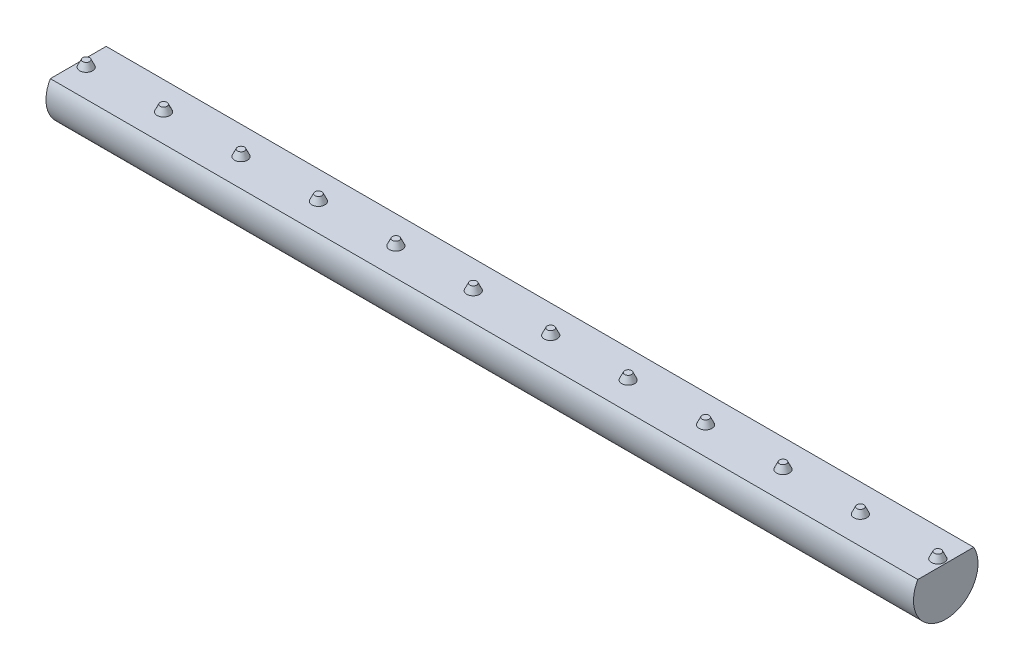
ISO-10303-21;
HEADER;
FILE_DESCRIPTION(('STEP AP214'),'2;1');
FILE_NAME('part.step','',(''),(''),'','','');
FILE_SCHEMA(('AUTOMOTIVE_DESIGN { 1 0 10303 214 1 1 1 1 }'));
ENDSEC;
DATA;
#1=APPLICATION_CONTEXT('core data for automotive mechanical design processes');
#2=APPLICATION_PROTOCOL_DEFINITION('international standard','automotive_design',2000,#1);
#3=PRODUCT_CONTEXT('',#1,'mechanical');
#4=PRODUCT('Part','Part','',(#3));
#5=PRODUCT_RELATED_PRODUCT_CATEGORY('part','',(#4));
#6=PRODUCT_DEFINITION_FORMATION('','',#4);
#7=PRODUCT_DEFINITION_CONTEXT('part definition',#1,'design');
#8=PRODUCT_DEFINITION('design','',#6,#7);
#9=PRODUCT_DEFINITION_SHAPE('','',#8);
#10=(LENGTH_UNIT() NAMED_UNIT(*) SI_UNIT(.MILLI.,.METRE.));
#11=(NAMED_UNIT(*) PLANE_ANGLE_UNIT() SI_UNIT($,.RADIAN.));
#12=(NAMED_UNIT(*) SI_UNIT($,.STERADIAN.) SOLID_ANGLE_UNIT());
#13=UNCERTAINTY_MEASURE_WITH_UNIT(LENGTH_MEASURE(1.E-05),#10,'distance_accuracy_value','');
#14=(GEOMETRIC_REPRESENTATION_CONTEXT(3) GLOBAL_UNCERTAINTY_ASSIGNED_CONTEXT((#13)) GLOBAL_UNIT_ASSIGNED_CONTEXT((#10,
#11,#12)) REPRESENTATION_CONTEXT('',''));
#15=CARTESIAN_POINT('',(0.,0.,0.));
#16=DIRECTION('',(0.,0.,1.));
#17=DIRECTION('',(1.,0.,0.));
#18=AXIS2_PLACEMENT_3D('',#15,#16,#17);
#19=CARTESIAN_POINT('',(134.46,2.5,4.33012701892219));
#20=DIRECTION('',(0.,-1.,0.));
#21=DIRECTION('',(0.,0.,-1.));
#22=AXIS2_PLACEMENT_3D('',#19,#20,#21);
#23=PLANE('',#22);
#24=CARTESIAN_POINT('',(121.229,2.5,0.));
#25=DIRECTION('',(0.,-1.,0.));
#26=DIRECTION('',(0.,0.,-1.));
#27=AXIS2_PLACEMENT_3D('',#24,#25,#26);
#28=CIRCLE('',#27,1.);
#29=CARTESIAN_POINT('',(121.229,2.5,-1.));
#30=VERTEX_POINT('',#29);
#31=EDGE_CURVE('E42',#30,#30,#28,.F.);
#32=ORIENTED_EDGE('',*,*,#31,.F.);
#33=EDGE_LOOP('',(#32));
#34=FACE_BOUND('',#33,.T.);
#35=CARTESIAN_POINT('',(97.229,2.5,0.));
#36=DIRECTION('',(0.,-1.,0.));
#37=DIRECTION('',(0.,0.,-1.));
#38=AXIS2_PLACEMENT_3D('',#35,#36,#37);
#39=CIRCLE('',#38,1.);
#40=CARTESIAN_POINT('',(97.229,2.5,-1.));
#41=VERTEX_POINT('',#40);
#42=EDGE_CURVE('E106',#41,#41,#39,.F.);
#43=ORIENTED_EDGE('',*,*,#42,.F.);
#44=EDGE_LOOP('',(#43));
#45=FACE_BOUND('',#44,.T.);
#46=CARTESIAN_POINT('',(73.229,2.5,0.));
#47=DIRECTION('',(0.,-1.,0.));
#48=DIRECTION('',(0.,0.,-1.));
#49=AXIS2_PLACEMENT_3D('',#46,#47,#48);
#50=CIRCLE('',#49,1.);
#51=CARTESIAN_POINT('',(73.229,2.5,-1.));
#52=VERTEX_POINT('',#51);
#53=EDGE_CURVE('E100',#52,#52,#50,.F.);
#54=ORIENTED_EDGE('',*,*,#53,.F.);
#55=EDGE_LOOP('',(#54));
#56=FACE_BOUND('',#55,.T.);
#57=CARTESIAN_POINT('',(49.229,2.5,0.));
#58=DIRECTION('',(0.,-1.,0.));
#59=DIRECTION('',(0.,0.,-1.));
#60=AXIS2_PLACEMENT_3D('',#57,#58,#59);
#61=CIRCLE('',#60,1.);
#62=CARTESIAN_POINT('',(49.229,2.5,-1.));
#63=VERTEX_POINT('',#62);
#64=EDGE_CURVE('E94',#63,#63,#61,.F.);
#65=ORIENTED_EDGE('',*,*,#64,.F.);
#66=EDGE_LOOP('',(#65));
#67=FACE_BOUND('',#66,.T.);
#68=CARTESIAN_POINT('',(25.229,2.5,0.));
#69=DIRECTION('',(0.,-1.,0.));
#70=DIRECTION('',(0.,0.,-1.));
#71=AXIS2_PLACEMENT_3D('',#68,#69,#70);
#72=CIRCLE('',#71,1.);
#73=CARTESIAN_POINT('',(25.229,2.5,-1.));
#74=VERTEX_POINT('',#73);
#75=EDGE_CURVE('E88',#74,#74,#72,.F.);
#76=ORIENTED_EDGE('',*,*,#75,.F.);
#77=EDGE_LOOP('',(#76));
#78=FACE_BOUND('',#77,.T.);
#79=CARTESIAN_POINT('',(1.229,2.5,0.));
#80=DIRECTION('',(0.,-1.,0.));
#81=DIRECTION('',(0.,0.,-1.));
#82=AXIS2_PLACEMENT_3D('',#79,#80,#81);
#83=CIRCLE('',#82,1.);
#84=CARTESIAN_POINT('',(1.229,2.5,-1.));
#85=VERTEX_POINT('',#84);
#86=EDGE_CURVE('E82',#85,#85,#83,.F.);
#87=ORIENTED_EDGE('',*,*,#86,.F.);
#88=EDGE_LOOP('',(#87));
#89=FACE_BOUND('',#88,.T.);
#90=DIRECTION('',(0.,0.,1.));
#91=VECTOR('',#90,1.);
#92=CARTESIAN_POINT('',(0.,2.5,4.33012701892219));
#93=LINE('',#92,#91);
#94=CARTESIAN_POINT('',(0.,2.5,-4.33012701892219));
#95=VERTEX_POINT('',#94);
#96=CARTESIAN_POINT('',(0.,2.5,4.33012701892219));
#97=VERTEX_POINT('',#96);
#98=EDGE_CURVE('E57',#95,#97,#93,.T.);
#99=ORIENTED_EDGE('',*,*,#98,.T.);
#100=DIRECTION('',(-1.,0.,0.));
#101=VECTOR('',#100,1.);
#102=CARTESIAN_POINT('',(134.46,2.5,4.33012701892219));
#103=LINE('',#102,#101);
#104=CARTESIAN_POINT('',(134.46,2.5,4.33012701892219));
#105=VERTEX_POINT('',#104);
#106=EDGE_CURVE('E62',#105,#97,#103,.T.);
#107=ORIENTED_EDGE('',*,*,#106,.F.);
#108=DIRECTION('',(0.,0.,1.));
#109=VECTOR('',#108,1.);
#110=CARTESIAN_POINT('',(134.46,2.5,4.33012701892219));
#111=LINE('',#110,#109);
#112=CARTESIAN_POINT('',(134.46,2.5,-4.33012701892219));
#113=VERTEX_POINT('',#112);
#114=EDGE_CURVE('E49',#113,#105,#111,.T.);
#115=ORIENTED_EDGE('',*,*,#114,.F.);
#116=DIRECTION('',(-1.,0.,0.));
#117=VECTOR('',#116,1.);
#118=CARTESIAN_POINT('',(134.46,2.5,-4.33012701892219));
#119=LINE('',#118,#117);
#120=EDGE_CURVE('E65',#113,#95,#119,.T.);
#121=ORIENTED_EDGE('',*,*,#120,.T.);
#122=EDGE_LOOP('',(#99,#107,#115,#121));
#123=FACE_BOUND('',#122,.T.);
#124=CARTESIAN_POINT('',(13.229,2.5,0.));
#125=DIRECTION('',(0.,-1.,0.));
#126=DIRECTION('',(0.,0.,-1.));
#127=AXIS2_PLACEMENT_3D('',#124,#125,#126);
#128=CIRCLE('',#127,1.);
#129=CARTESIAN_POINT('',(13.229,2.5,-1.));
#130=VERTEX_POINT('',#129);
#131=EDGE_CURVE('E85',#130,#130,#128,.F.);
#132=ORIENTED_EDGE('',*,*,#131,.F.);
#133=EDGE_LOOP('',(#132));
#134=FACE_BOUND('',#133,.T.);
#135=CARTESIAN_POINT('',(37.229,2.5,0.));
#136=DIRECTION('',(0.,-1.,0.));
#137=DIRECTION('',(0.,0.,-1.));
#138=AXIS2_PLACEMENT_3D('',#135,#136,#137);
#139=CIRCLE('',#138,1.);
#140=CARTESIAN_POINT('',(37.229,2.5,-1.));
#141=VERTEX_POINT('',#140);
#142=EDGE_CURVE('E91',#141,#141,#139,.F.);
#143=ORIENTED_EDGE('',*,*,#142,.F.);
#144=EDGE_LOOP('',(#143));
#145=FACE_BOUND('',#144,.T.);
#146=CARTESIAN_POINT('',(61.229,2.5,0.));
#147=DIRECTION('',(0.,-1.,0.));
#148=DIRECTION('',(0.,0.,-1.));
#149=AXIS2_PLACEMENT_3D('',#146,#147,#148);
#150=CIRCLE('',#149,1.);
#151=CARTESIAN_POINT('',(61.229,2.5,-1.));
#152=VERTEX_POINT('',#151);
#153=EDGE_CURVE('E97',#152,#152,#150,.F.);
#154=ORIENTED_EDGE('',*,*,#153,.F.);
#155=EDGE_LOOP('',(#154));
#156=FACE_BOUND('',#155,.T.);
#157=CARTESIAN_POINT('',(85.229,2.5,0.));
#158=DIRECTION('',(0.,-1.,0.));
#159=DIRECTION('',(0.,0.,-1.));
#160=AXIS2_PLACEMENT_3D('',#157,#158,#159);
#161=CIRCLE('',#160,1.);
#162=CARTESIAN_POINT('',(85.229,2.5,-1.));
#163=VERTEX_POINT('',#162);
#164=EDGE_CURVE('E103',#163,#163,#161,.F.);
#165=ORIENTED_EDGE('',*,*,#164,.F.);
#166=EDGE_LOOP('',(#165));
#167=FACE_BOUND('',#166,.T.);
#168=CARTESIAN_POINT('',(109.229,2.5,0.));
#169=DIRECTION('',(0.,-1.,0.));
#170=DIRECTION('',(0.,0.,-1.));
#171=AXIS2_PLACEMENT_3D('',#168,#169,#170);
#172=CIRCLE('',#171,1.);
#173=CARTESIAN_POINT('',(109.229,2.5,-1.));
#174=VERTEX_POINT('',#173);
#175=EDGE_CURVE('E109',#174,#174,#172,.F.);
#176=ORIENTED_EDGE('',*,*,#175,.F.);
#177=EDGE_LOOP('',(#176));
#178=FACE_BOUND('',#177,.T.);
#179=CARTESIAN_POINT('',(133.229,2.5,0.));
#180=DIRECTION('',(0.,-1.,0.));
#181=DIRECTION('',(0.,0.,-1.));
#182=AXIS2_PLACEMENT_3D('',#179,#180,#181);
#183=CIRCLE('',#182,1.);
#184=CARTESIAN_POINT('',(133.229,2.5,-1.));
#185=VERTEX_POINT('',#184);
#186=EDGE_CURVE('E11',#185,#185,#183,.F.);
#187=ORIENTED_EDGE('',*,*,#186,.F.);
#188=EDGE_LOOP('',(#187));
#189=FACE_BOUND('',#188,.T.);
#190=ADVANCED_FACE('F33',(#34,#45,#56,#67,#78,#89,#123,#134,#145,#156,#167,#178,#189),#23,.F.);
#191=CARTESIAN_POINT('',(134.46,0.,0.));
#192=DIRECTION('',(-1.,0.,0.));
#193=DIRECTION('',(0.,0.,1.));
#194=AXIS2_PLACEMENT_3D('',#191,#192,#193);
#195=CYLINDRICAL_SURFACE('',#194,5.);
#196=CARTESIAN_POINT('',(0.,0.,0.));
#197=DIRECTION('',(1.,0.,0.));
#198=DIRECTION('',(0.,0.,-1.));
#199=AXIS2_PLACEMENT_3D('',#196,#197,#198);
#200=CIRCLE('',#199,5.);
#201=EDGE_CURVE('E68',#97,#95,#200,.T.);
#202=ORIENTED_EDGE('',*,*,#201,.T.);
#203=ORIENTED_EDGE('',*,*,#120,.F.);
#204=CARTESIAN_POINT('',(134.46,0.,0.));
#205=DIRECTION('',(1.,0.,0.));
#206=DIRECTION('',(0.,0.,-1.));
#207=AXIS2_PLACEMENT_3D('',#204,#205,#206);
#208=CIRCLE('',#207,5.);
#209=EDGE_CURVE('E67',#105,#113,#208,.T.);
#210=ORIENTED_EDGE('',*,*,#209,.F.);
#211=ORIENTED_EDGE('',*,*,#106,.T.);
#212=EDGE_LOOP('',(#202,#203,#210,#211));
#213=FACE_BOUND('',#212,.T.);
#214=ADVANCED_FACE('F35',(#213),#195,.T.);
#215=CARTESIAN_POINT('',(134.46,0.,0.));
#216=DIRECTION('',(1.,0.,0.));
#217=DIRECTION('',(0.,0.,-1.));
#218=AXIS2_PLACEMENT_3D('',#215,#216,#217);
#219=PLANE('',#218);
#220=ORIENTED_EDGE('',*,*,#209,.T.);
#221=ORIENTED_EDGE('',*,*,#114,.T.);
#222=EDGE_LOOP('',(#220,#221));
#223=FACE_BOUND('',#222,.T.);
#224=ADVANCED_FACE('F140',(#223),#219,.T.);
#225=CARTESIAN_POINT('',(0.,0.,0.));
#226=DIRECTION('',(1.,0.,0.));
#227=DIRECTION('',(0.,0.,-1.));
#228=AXIS2_PLACEMENT_3D('',#225,#226,#227);
#229=PLANE('',#228);
#230=ORIENTED_EDGE('',*,*,#201,.F.);
#231=ORIENTED_EDGE('',*,*,#98,.F.);
#232=EDGE_LOOP('',(#230,#231));
#233=FACE_BOUND('',#232,.T.);
#234=ADVANCED_FACE('F72',(#233),#229,.F.);
#235=CARTESIAN_POINT('',(1.229,2.5,0.));
#236=DIRECTION('',(0.,-1.,0.));
#237=DIRECTION('',(0.,0.,1.));
#238=AXIS2_PLACEMENT_3D('',#235,#236,#237);
#239=CONICAL_SURFACE('',#238,1.,0.436332312998583);
#240=CARTESIAN_POINT('',(1.229,3.5,0.));
#241=DIRECTION('',(0.,1.,0.));
#242=DIRECTION('',(0.,0.,1.));
#243=AXIS2_PLACEMENT_3D('',#240,#241,#242);
#244=CIRCLE('',#243,0.533692341845001);
#245=CARTESIAN_POINT('',(1.229,3.5,0.533692341845001));
#246=VERTEX_POINT('',#245);
#247=EDGE_CURVE('E73',#246,#246,#244,.T.);
#248=ORIENTED_EDGE('',*,*,#247,.F.);
#249=EDGE_LOOP('',(#248));
#250=FACE_BOUND('',#249,.T.);
#251=ORIENTED_EDGE('',*,*,#86,.T.);
#252=EDGE_LOOP('',(#251));
#253=FACE_BOUND('',#252,.T.);
#254=ADVANCED_FACE('F128',(#250,#253),#239,.T.);
#255=CARTESIAN_POINT('',(1.229,3.5,0.));
#256=DIRECTION('',(0.,1.,0.));
#257=DIRECTION('',(0.,0.,1.));
#258=AXIS2_PLACEMENT_3D('',#255,#256,#257);
#259=PLANE('',#258);
#260=ORIENTED_EDGE('',*,*,#247,.T.);
#261=EDGE_LOOP('',(#260));
#262=FACE_BOUND('',#261,.T.);
#263=ADVANCED_FACE('F130',(#262),#259,.T.);
#264=CARTESIAN_POINT('',(13.229,2.5,0.));
#265=DIRECTION('',(0.,-1.,0.));
#266=DIRECTION('',(0.,0.,1.));
#267=AXIS2_PLACEMENT_3D('',#264,#265,#266);
#268=CONICAL_SURFACE('',#267,1.,0.436332312998583);
#269=CARTESIAN_POINT('',(13.229,3.5,0.));
#270=DIRECTION('',(0.,1.,0.));
#271=DIRECTION('',(0.,0.,1.));
#272=AXIS2_PLACEMENT_3D('',#269,#270,#271);
#273=CIRCLE('',#272,0.533692341845001);
#274=CARTESIAN_POINT('',(13.229,3.5,0.533692341845001));
#275=VERTEX_POINT('',#274);
#276=EDGE_CURVE('E76',#275,#275,#273,.T.);
#277=ORIENTED_EDGE('',*,*,#276,.F.);
#278=EDGE_LOOP('',(#277));
#279=FACE_BOUND('',#278,.T.);
#280=ORIENTED_EDGE('',*,*,#131,.T.);
#281=EDGE_LOOP('',(#280));
#282=FACE_BOUND('',#281,.T.);
#283=ADVANCED_FACE('F137',(#279,#282),#268,.T.);
#284=CARTESIAN_POINT('',(13.229,3.5,0.));
#285=DIRECTION('',(0.,1.,0.));
#286=DIRECTION('',(0.,0.,1.));
#287=AXIS2_PLACEMENT_3D('',#284,#285,#286);
#288=PLANE('',#287);
#289=ORIENTED_EDGE('',*,*,#276,.T.);
#290=EDGE_LOOP('',(#289));
#291=FACE_BOUND('',#290,.T.);
#292=ADVANCED_FACE('F266',(#291),#288,.T.);
#293=CARTESIAN_POINT('',(25.229,2.5,0.));
#294=DIRECTION('',(0.,-1.,0.));
#295=DIRECTION('',(0.,0.,1.));
#296=AXIS2_PLACEMENT_3D('',#293,#294,#295);
#297=CONICAL_SURFACE('',#296,1.,0.436332312998583);
#298=CARTESIAN_POINT('',(25.229,3.5,0.));
#299=DIRECTION('',(0.,1.,0.));
#300=DIRECTION('',(0.,0.,1.));
#301=AXIS2_PLACEMENT_3D('',#298,#299,#300);
#302=CIRCLE('',#301,0.533692341845001);
#303=CARTESIAN_POINT('',(25.229,3.5,0.533692341845001));
#304=VERTEX_POINT('',#303);
#305=EDGE_CURVE('E152',#304,#304,#302,.T.);
#306=ORIENTED_EDGE('',*,*,#305,.F.);
#307=EDGE_LOOP('',(#306));
#308=FACE_BOUND('',#307,.T.);
#309=ORIENTED_EDGE('',*,*,#75,.T.);
#310=EDGE_LOOP('',(#309));
#311=FACE_BOUND('',#310,.T.);
#312=ADVANCED_FACE('F262',(#308,#311),#297,.T.);
#313=CARTESIAN_POINT('',(25.229,3.5,0.));
#314=DIRECTION('',(0.,1.,0.));
#315=DIRECTION('',(0.,0.,1.));
#316=AXIS2_PLACEMENT_3D('',#313,#314,#315);
#317=PLANE('',#316);
#318=ORIENTED_EDGE('',*,*,#305,.T.);
#319=EDGE_LOOP('',(#318));
#320=FACE_BOUND('',#319,.T.);
#321=ADVANCED_FACE('F258',(#320),#317,.T.);
#322=CARTESIAN_POINT('',(37.229,2.5,0.));
#323=DIRECTION('',(0.,-1.,0.));
#324=DIRECTION('',(0.,0.,1.));
#325=AXIS2_PLACEMENT_3D('',#322,#323,#324);
#326=CONICAL_SURFACE('',#325,1.,0.436332312998583);
#327=CARTESIAN_POINT('',(37.229,3.5,0.));
#328=DIRECTION('',(0.,1.,0.));
#329=DIRECTION('',(0.,0.,1.));
#330=AXIS2_PLACEMENT_3D('',#327,#328,#329);
#331=CIRCLE('',#330,0.533692341845001);
#332=CARTESIAN_POINT('',(37.229,3.5,0.533692341845001));
#333=VERTEX_POINT('',#332);
#334=EDGE_CURVE('E155',#333,#333,#331,.T.);
#335=ORIENTED_EDGE('',*,*,#334,.F.);
#336=EDGE_LOOP('',(#335));
#337=FACE_BOUND('',#336,.T.);
#338=ORIENTED_EDGE('',*,*,#142,.T.);
#339=EDGE_LOOP('',(#338));
#340=FACE_BOUND('',#339,.T.);
#341=ADVANCED_FACE('F254',(#337,#340),#326,.T.);
#342=CARTESIAN_POINT('',(37.229,3.5,0.));
#343=DIRECTION('',(0.,1.,0.));
#344=DIRECTION('',(0.,0.,1.));
#345=AXIS2_PLACEMENT_3D('',#342,#343,#344);
#346=PLANE('',#345);
#347=ORIENTED_EDGE('',*,*,#334,.T.);
#348=EDGE_LOOP('',(#347));
#349=FACE_BOUND('',#348,.T.);
#350=ADVANCED_FACE('F250',(#349),#346,.T.);
#351=CARTESIAN_POINT('',(49.229,2.5,0.));
#352=DIRECTION('',(0.,-1.,0.));
#353=DIRECTION('',(0.,0.,1.));
#354=AXIS2_PLACEMENT_3D('',#351,#352,#353);
#355=CONICAL_SURFACE('',#354,1.,0.436332312998583);
#356=CARTESIAN_POINT('',(49.229,3.5,0.));
#357=DIRECTION('',(0.,1.,0.));
#358=DIRECTION('',(0.,0.,1.));
#359=AXIS2_PLACEMENT_3D('',#356,#357,#358);
#360=CIRCLE('',#359,0.533692341845001);
#361=CARTESIAN_POINT('',(49.229,3.5,0.533692341845001));
#362=VERTEX_POINT('',#361);
#363=EDGE_CURVE('E158',#362,#362,#360,.T.);
#364=ORIENTED_EDGE('',*,*,#363,.F.);
#365=EDGE_LOOP('',(#364));
#366=FACE_BOUND('',#365,.T.);
#367=ORIENTED_EDGE('',*,*,#64,.T.);
#368=EDGE_LOOP('',(#367));
#369=FACE_BOUND('',#368,.T.);
#370=ADVANCED_FACE('F246',(#366,#369),#355,.T.);
#371=CARTESIAN_POINT('',(49.229,3.5,0.));
#372=DIRECTION('',(0.,1.,0.));
#373=DIRECTION('',(0.,0.,1.));
#374=AXIS2_PLACEMENT_3D('',#371,#372,#373);
#375=PLANE('',#374);
#376=ORIENTED_EDGE('',*,*,#363,.T.);
#377=EDGE_LOOP('',(#376));
#378=FACE_BOUND('',#377,.T.);
#379=ADVANCED_FACE('F242',(#378),#375,.T.);
#380=CARTESIAN_POINT('',(61.229,2.5,0.));
#381=DIRECTION('',(0.,-1.,0.));
#382=DIRECTION('',(0.,0.,1.));
#383=AXIS2_PLACEMENT_3D('',#380,#381,#382);
#384=CONICAL_SURFACE('',#383,1.,0.436332312998583);
#385=CARTESIAN_POINT('',(61.229,3.5,0.));
#386=DIRECTION('',(0.,1.,0.));
#387=DIRECTION('',(0.,0.,1.));
#388=AXIS2_PLACEMENT_3D('',#385,#386,#387);
#389=CIRCLE('',#388,0.533692341845001);
#390=CARTESIAN_POINT('',(61.229,3.5,0.533692341845001));
#391=VERTEX_POINT('',#390);
#392=EDGE_CURVE('E161',#391,#391,#389,.T.);
#393=ORIENTED_EDGE('',*,*,#392,.F.);
#394=EDGE_LOOP('',(#393));
#395=FACE_BOUND('',#394,.T.);
#396=ORIENTED_EDGE('',*,*,#153,.T.);
#397=EDGE_LOOP('',(#396));
#398=FACE_BOUND('',#397,.T.);
#399=ADVANCED_FACE('F238',(#395,#398),#384,.T.);
#400=CARTESIAN_POINT('',(61.229,3.5,0.));
#401=DIRECTION('',(0.,1.,0.));
#402=DIRECTION('',(0.,0.,1.));
#403=AXIS2_PLACEMENT_3D('',#400,#401,#402);
#404=PLANE('',#403);
#405=ORIENTED_EDGE('',*,*,#392,.T.);
#406=EDGE_LOOP('',(#405));
#407=FACE_BOUND('',#406,.T.);
#408=ADVANCED_FACE('F234',(#407),#404,.T.);
#409=CARTESIAN_POINT('',(73.229,2.5,0.));
#410=DIRECTION('',(0.,-1.,0.));
#411=DIRECTION('',(0.,0.,1.));
#412=AXIS2_PLACEMENT_3D('',#409,#410,#411);
#413=CONICAL_SURFACE('',#412,1.,0.436332312998583);
#414=CARTESIAN_POINT('',(73.229,3.5,0.));
#415=DIRECTION('',(0.,1.,0.));
#416=DIRECTION('',(0.,0.,1.));
#417=AXIS2_PLACEMENT_3D('',#414,#415,#416);
#418=CIRCLE('',#417,0.533692341845001);
#419=CARTESIAN_POINT('',(73.229,3.5,0.533692341845001));
#420=VERTEX_POINT('',#419);
#421=EDGE_CURVE('E164',#420,#420,#418,.T.);
#422=ORIENTED_EDGE('',*,*,#421,.F.);
#423=EDGE_LOOP('',(#422));
#424=FACE_BOUND('',#423,.T.);
#425=ORIENTED_EDGE('',*,*,#53,.T.);
#426=EDGE_LOOP('',(#425));
#427=FACE_BOUND('',#426,.T.);
#428=ADVANCED_FACE('F230',(#424,#427),#413,.T.);
#429=CARTESIAN_POINT('',(73.229,3.5,0.));
#430=DIRECTION('',(0.,1.,0.));
#431=DIRECTION('',(0.,0.,1.));
#432=AXIS2_PLACEMENT_3D('',#429,#430,#431);
#433=PLANE('',#432);
#434=ORIENTED_EDGE('',*,*,#421,.T.);
#435=EDGE_LOOP('',(#434));
#436=FACE_BOUND('',#435,.T.);
#437=ADVANCED_FACE('F226',(#436),#433,.T.);
#438=CARTESIAN_POINT('',(85.229,2.5,0.));
#439=DIRECTION('',(0.,-1.,0.));
#440=DIRECTION('',(0.,0.,1.));
#441=AXIS2_PLACEMENT_3D('',#438,#439,#440);
#442=CONICAL_SURFACE('',#441,1.,0.436332312998583);
#443=CARTESIAN_POINT('',(85.229,3.5,0.));
#444=DIRECTION('',(0.,1.,0.));
#445=DIRECTION('',(0.,0.,1.));
#446=AXIS2_PLACEMENT_3D('',#443,#444,#445);
#447=CIRCLE('',#446,0.533692341845001);
#448=CARTESIAN_POINT('',(85.229,3.5,0.533692341845001));
#449=VERTEX_POINT('',#448);
#450=EDGE_CURVE('E167',#449,#449,#447,.T.);
#451=ORIENTED_EDGE('',*,*,#450,.F.);
#452=EDGE_LOOP('',(#451));
#453=FACE_BOUND('',#452,.T.);
#454=ORIENTED_EDGE('',*,*,#164,.T.);
#455=EDGE_LOOP('',(#454));
#456=FACE_BOUND('',#455,.T.);
#457=ADVANCED_FACE('F222',(#453,#456),#442,.T.);
#458=CARTESIAN_POINT('',(85.229,3.5,0.));
#459=DIRECTION('',(0.,1.,0.));
#460=DIRECTION('',(0.,0.,1.));
#461=AXIS2_PLACEMENT_3D('',#458,#459,#460);
#462=PLANE('',#461);
#463=ORIENTED_EDGE('',*,*,#450,.T.);
#464=EDGE_LOOP('',(#463));
#465=FACE_BOUND('',#464,.T.);
#466=ADVANCED_FACE('F218',(#465),#462,.T.);
#467=CARTESIAN_POINT('',(97.229,2.5,0.));
#468=DIRECTION('',(0.,-1.,0.));
#469=DIRECTION('',(0.,0.,1.));
#470=AXIS2_PLACEMENT_3D('',#467,#468,#469);
#471=CONICAL_SURFACE('',#470,1.,0.436332312998583);
#472=CARTESIAN_POINT('',(97.229,3.5,0.));
#473=DIRECTION('',(0.,1.,0.));
#474=DIRECTION('',(0.,0.,1.));
#475=AXIS2_PLACEMENT_3D('',#472,#473,#474);
#476=CIRCLE('',#475,0.533692341845001);
#477=CARTESIAN_POINT('',(97.229,3.5,0.533692341845001));
#478=VERTEX_POINT('',#477);
#479=EDGE_CURVE('E170',#478,#478,#476,.T.);
#480=ORIENTED_EDGE('',*,*,#479,.F.);
#481=EDGE_LOOP('',(#480));
#482=FACE_BOUND('',#481,.T.);
#483=ORIENTED_EDGE('',*,*,#42,.T.);
#484=EDGE_LOOP('',(#483));
#485=FACE_BOUND('',#484,.T.);
#486=ADVANCED_FACE('F214',(#482,#485),#471,.T.);
#487=CARTESIAN_POINT('',(97.229,3.5,0.));
#488=DIRECTION('',(0.,1.,0.));
#489=DIRECTION('',(0.,0.,1.));
#490=AXIS2_PLACEMENT_3D('',#487,#488,#489);
#491=PLANE('',#490);
#492=ORIENTED_EDGE('',*,*,#479,.T.);
#493=EDGE_LOOP('',(#492));
#494=FACE_BOUND('',#493,.T.);
#495=ADVANCED_FACE('F210',(#494),#491,.T.);
#496=CARTESIAN_POINT('',(109.229,2.5,0.));
#497=DIRECTION('',(0.,-1.,0.));
#498=DIRECTION('',(0.,0.,1.));
#499=AXIS2_PLACEMENT_3D('',#496,#497,#498);
#500=CONICAL_SURFACE('',#499,1.,0.436332312998583);
#501=CARTESIAN_POINT('',(109.229,3.5,0.));
#502=DIRECTION('',(0.,1.,0.));
#503=DIRECTION('',(0.,0.,1.));
#504=AXIS2_PLACEMENT_3D('',#501,#502,#503);
#505=CIRCLE('',#504,0.533692341845001);
#506=CARTESIAN_POINT('',(109.229,3.5,0.533692341845001));
#507=VERTEX_POINT('',#506);
#508=EDGE_CURVE('E173',#507,#507,#505,.T.);
#509=ORIENTED_EDGE('',*,*,#508,.F.);
#510=EDGE_LOOP('',(#509));
#511=FACE_BOUND('',#510,.T.);
#512=ORIENTED_EDGE('',*,*,#175,.T.);
#513=EDGE_LOOP('',(#512));
#514=FACE_BOUND('',#513,.T.);
#515=ADVANCED_FACE('F206',(#511,#514),#500,.T.);
#516=CARTESIAN_POINT('',(109.229,3.5,0.));
#517=DIRECTION('',(0.,1.,0.));
#518=DIRECTION('',(0.,0.,1.));
#519=AXIS2_PLACEMENT_3D('',#516,#517,#518);
#520=PLANE('',#519);
#521=ORIENTED_EDGE('',*,*,#508,.T.);
#522=EDGE_LOOP('',(#521));
#523=FACE_BOUND('',#522,.T.);
#524=ADVANCED_FACE('F202',(#523),#520,.T.);
#525=CARTESIAN_POINT('',(121.229,2.5,0.));
#526=DIRECTION('',(0.,-1.,0.));
#527=DIRECTION('',(0.,0.,1.));
#528=AXIS2_PLACEMENT_3D('',#525,#526,#527);
#529=CONICAL_SURFACE('',#528,1.,0.436332312998583);
#530=CARTESIAN_POINT('',(121.229,3.5,0.));
#531=DIRECTION('',(0.,1.,0.));
#532=DIRECTION('',(0.,0.,1.));
#533=AXIS2_PLACEMENT_3D('',#530,#531,#532);
#534=CIRCLE('',#533,0.533692341845001);
#535=CARTESIAN_POINT('',(121.229,3.5,0.533692341845001));
#536=VERTEX_POINT('',#535);
#537=EDGE_CURVE('E176',#536,#536,#534,.T.);
#538=ORIENTED_EDGE('',*,*,#537,.F.);
#539=EDGE_LOOP('',(#538));
#540=FACE_BOUND('',#539,.T.);
#541=ORIENTED_EDGE('',*,*,#31,.T.);
#542=EDGE_LOOP('',(#541));
#543=FACE_BOUND('',#542,.T.);
#544=ADVANCED_FACE('F114',(#540,#543),#529,.T.);
#545=CARTESIAN_POINT('',(121.229,3.5,0.));
#546=DIRECTION('',(0.,1.,0.));
#547=DIRECTION('',(0.,0.,1.));
#548=AXIS2_PLACEMENT_3D('',#545,#546,#547);
#549=PLANE('',#548);
#550=ORIENTED_EDGE('',*,*,#537,.T.);
#551=EDGE_LOOP('',(#550));
#552=FACE_BOUND('',#551,.T.);
#553=ADVANCED_FACE('F188',(#552),#549,.T.);
#554=CARTESIAN_POINT('',(133.229,2.5,0.));
#555=DIRECTION('',(0.,-1.,0.));
#556=DIRECTION('',(0.,0.,1.));
#557=AXIS2_PLACEMENT_3D('',#554,#555,#556);
#558=CONICAL_SURFACE('',#557,1.,0.436332312998583);
#559=CARTESIAN_POINT('',(133.229,3.5,0.));
#560=DIRECTION('',(0.,1.,0.));
#561=DIRECTION('',(0.,0.,1.));
#562=AXIS2_PLACEMENT_3D('',#559,#560,#561);
#563=CIRCLE('',#562,0.533692341845001);
#564=CARTESIAN_POINT('',(133.229,3.5,0.533692341845001));
#565=VERTEX_POINT('',#564);
#566=EDGE_CURVE('E179',#565,#565,#563,.T.);
#567=ORIENTED_EDGE('',*,*,#566,.F.);
#568=EDGE_LOOP('',(#567));
#569=FACE_BOUND('',#568,.T.);
#570=ORIENTED_EDGE('',*,*,#186,.T.);
#571=EDGE_LOOP('',(#570));
#572=FACE_BOUND('',#571,.T.);
#573=ADVANCED_FACE('F185',(#569,#572),#558,.T.);
#574=CARTESIAN_POINT('',(133.229,3.5,0.));
#575=DIRECTION('',(0.,1.,0.));
#576=DIRECTION('',(0.,0.,1.));
#577=AXIS2_PLACEMENT_3D('',#574,#575,#576);
#578=PLANE('',#577);
#579=ORIENTED_EDGE('',*,*,#566,.T.);
#580=EDGE_LOOP('',(#579));
#581=FACE_BOUND('',#580,.T.);
#582=ADVANCED_FACE('F183',(#581),#578,.T.);
#583=CLOSED_SHELL('',(#190,#214,#224,#234,#254,#263,#283,#292,#312,#321,#341,#350,#370,#379,
#399,#408,#428,#437,#457,#466,#486,#495,#515,#524,#544,#553,#573,#582));
#584=MANIFOLD_SOLID_BREP('B2',#583);
#585=ADVANCED_BREP_SHAPE_REPRESENTATION('',(#18,#584),#14);
#586=SHAPE_DEFINITION_REPRESENTATION(#9,#585);
ENDSEC;
END-ISO-10303-21;
